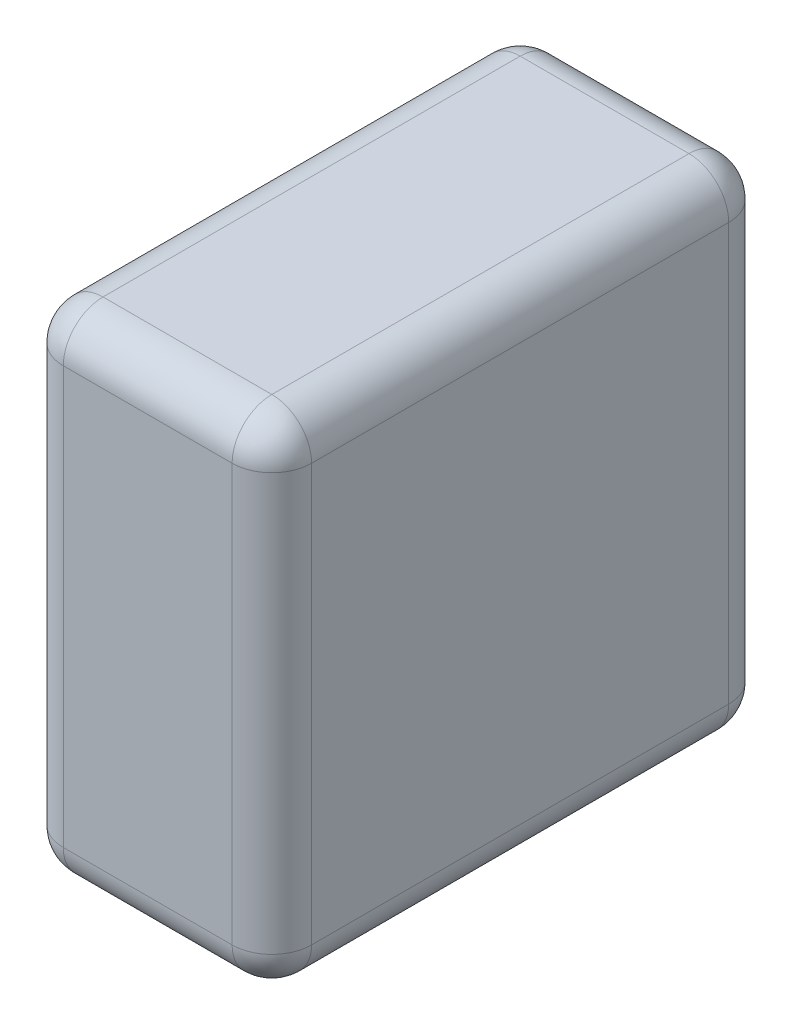
ISO-10303-21;
HEADER;
FILE_DESCRIPTION(('STEP AP214'),'2;1');
FILE_NAME('part.step','',(''),(''),'','','');
FILE_SCHEMA(('AUTOMOTIVE_DESIGN { 1 0 10303 214 1 1 1 1 }'));
ENDSEC;
DATA;
#1=APPLICATION_CONTEXT('core data for automotive mechanical design processes');
#2=APPLICATION_PROTOCOL_DEFINITION('international standard','automotive_design',2000,#1);
#3=PRODUCT_CONTEXT('',#1,'mechanical');
#4=PRODUCT('Part','Part','',(#3));
#5=PRODUCT_RELATED_PRODUCT_CATEGORY('part','',(#4));
#6=PRODUCT_DEFINITION_FORMATION('','',#4);
#7=PRODUCT_DEFINITION_CONTEXT('part definition',#1,'design');
#8=PRODUCT_DEFINITION('design','',#6,#7);
#9=PRODUCT_DEFINITION_SHAPE('','',#8);
#10=(LENGTH_UNIT() NAMED_UNIT(*) SI_UNIT(.MILLI.,.METRE.));
#11=(NAMED_UNIT(*) PLANE_ANGLE_UNIT() SI_UNIT($,.RADIAN.));
#12=(NAMED_UNIT(*) SI_UNIT($,.STERADIAN.) SOLID_ANGLE_UNIT());
#13=UNCERTAINTY_MEASURE_WITH_UNIT(LENGTH_MEASURE(1.E-05),#10,'distance_accuracy_value','');
#14=(GEOMETRIC_REPRESENTATION_CONTEXT(3) GLOBAL_UNCERTAINTY_ASSIGNED_CONTEXT((#13)) GLOBAL_UNIT_ASSIGNED_CONTEXT((#10,
#11,#12)) REPRESENTATION_CONTEXT('',''));
#15=CARTESIAN_POINT('',(0.,0.,0.));
#16=DIRECTION('',(0.,0.,1.));
#17=DIRECTION('',(1.,0.,0.));
#18=AXIS2_PLACEMENT_3D('',#15,#16,#17);
#19=CARTESIAN_POINT('',(0.79375,1.5875,1.5875));
#20=DIRECTION('',(0.,0.,-1.));
#21=DIRECTION('',(0.,1.,0.));
#22=AXIS2_PLACEMENT_3D('',#19,#20,#21);
#23=PLANE('',#22);
#24=DIRECTION('',(-1.,0.,0.));
#25=VECTOR('',#24,1.);
#26=CARTESIAN_POINT('',(0.79375,1.3335,1.5875));
#27=LINE('',#26,#25);
#28=CARTESIAN_POINT('',(0.53975,1.3335,1.5875));
#29=VERTEX_POINT('',#28);
#30=CARTESIAN_POINT('',(-0.53975,1.3335,1.5875));
#31=VERTEX_POINT('',#30);
#32=EDGE_CURVE('E514',#29,#31,#27,.T.);
#33=ORIENTED_EDGE('',*,*,#32,.T.);
#34=DIRECTION('',(0.,-1.,0.));
#35=VECTOR('',#34,1.);
#36=CARTESIAN_POINT('',(-0.53975,1.5875,1.5875));
#37=LINE('',#36,#35);
#38=CARTESIAN_POINT('',(-0.53975,-1.3335,1.5875));
#39=VERTEX_POINT('',#38);
#40=EDGE_CURVE('E519',#31,#39,#37,.T.);
#41=ORIENTED_EDGE('',*,*,#40,.T.);
#42=DIRECTION('',(-1.,0.,0.));
#43=VECTOR('',#42,1.);
#44=CARTESIAN_POINT('',(0.79375,-1.3335,1.5875));
#45=LINE('',#44,#43);
#46=CARTESIAN_POINT('',(0.53975,-1.3335,1.5875));
#47=VERTEX_POINT('',#46);
#48=EDGE_CURVE('E516',#39,#47,#45,.F.);
#49=ORIENTED_EDGE('',*,*,#48,.T.);
#50=DIRECTION('',(0.,-1.,0.));
#51=VECTOR('',#50,1.);
#52=CARTESIAN_POINT('',(0.53975,1.5875,1.5875));
#53=LINE('',#52,#51);
#54=EDGE_CURVE('E512',#47,#29,#53,.F.);
#55=ORIENTED_EDGE('',*,*,#54,.T.);
#56=EDGE_LOOP('',(#33,#41,#49,#55));
#57=FACE_BOUND('',#56,.T.);
#58=ADVANCED_FACE('F372',(#57),#23,.F.);
#59=CARTESIAN_POINT('',(0.79375,-1.5875,1.5875));
#60=DIRECTION('',(0.,1.,0.));
#61=DIRECTION('',(0.,0.,1.));
#62=AXIS2_PLACEMENT_3D('',#59,#60,#61);
#63=PLANE('',#62);
#64=DIRECTION('',(-1.,0.,0.));
#65=VECTOR('',#64,1.);
#66=CARTESIAN_POINT('',(0.79375,-1.5875,1.3335));
#67=LINE('',#66,#65);
#68=CARTESIAN_POINT('',(0.53975,-1.5875,1.3335));
#69=VERTEX_POINT('',#68);
#70=CARTESIAN_POINT('',(-0.53975,-1.5875,1.3335));
#71=VERTEX_POINT('',#70);
#72=EDGE_CURVE('E505',#69,#71,#67,.T.);
#73=ORIENTED_EDGE('',*,*,#72,.T.);
#74=DIRECTION('',(0.,0.,-1.));
#75=VECTOR('',#74,1.);
#76=CARTESIAN_POINT('',(-0.53975,-1.5875,1.5875));
#77=LINE('',#76,#75);
#78=CARTESIAN_POINT('',(-0.53975,-1.5875,-1.3335));
#79=VERTEX_POINT('',#78);
#80=EDGE_CURVE('E510',#71,#79,#77,.T.);
#81=ORIENTED_EDGE('',*,*,#80,.T.);
#82=DIRECTION('',(-1.,0.,0.));
#83=VECTOR('',#82,1.);
#84=CARTESIAN_POINT('',(0.79375,-1.5875,-1.3335));
#85=LINE('',#84,#83);
#86=CARTESIAN_POINT('',(0.53975,-1.5875,-1.3335));
#87=VERTEX_POINT('',#86);
#88=EDGE_CURVE('E507',#79,#87,#85,.F.);
#89=ORIENTED_EDGE('',*,*,#88,.T.);
#90=DIRECTION('',(0.,0.,-1.));
#91=VECTOR('',#90,1.);
#92=CARTESIAN_POINT('',(0.53975,-1.5875,1.5875));
#93=LINE('',#92,#91);
#94=EDGE_CURVE('E503',#87,#69,#93,.F.);
#95=ORIENTED_EDGE('',*,*,#94,.T.);
#96=EDGE_LOOP('',(#73,#81,#89,#95));
#97=FACE_BOUND('',#96,.T.);
#98=ADVANCED_FACE('F631',(#97),#63,.F.);
#99=CARTESIAN_POINT('',(0.79375,1.5875,-1.5875));
#100=DIRECTION('',(0.,0.,1.));
#101=DIRECTION('',(0.,-1.,0.));
#102=AXIS2_PLACEMENT_3D('',#99,#100,#101);
#103=PLANE('',#102);
#104=DIRECTION('',(-1.,0.,0.));
#105=VECTOR('',#104,1.);
#106=CARTESIAN_POINT('',(0.79375,-1.3335,-1.5875));
#107=LINE('',#106,#105);
#108=CARTESIAN_POINT('',(0.53975,-1.3335,-1.5875));
#109=VERTEX_POINT('',#108);
#110=CARTESIAN_POINT('',(-0.53975,-1.3335,-1.5875));
#111=VERTEX_POINT('',#110);
#112=EDGE_CURVE('E468',#109,#111,#107,.T.);
#113=ORIENTED_EDGE('',*,*,#112,.T.);
#114=DIRECTION('',(0.,1.,0.));
#115=VECTOR('',#114,1.);
#116=CARTESIAN_POINT('',(-0.53975,1.5875,-1.5875));
#117=LINE('',#116,#115);
#118=CARTESIAN_POINT('',(-0.53975,1.3335,-1.5875));
#119=VERTEX_POINT('',#118);
#120=EDGE_CURVE('E464',#111,#119,#117,.T.);
#121=ORIENTED_EDGE('',*,*,#120,.T.);
#122=DIRECTION('',(-1.,0.,0.));
#123=VECTOR('',#122,1.);
#124=CARTESIAN_POINT('',(0.79375,1.3335,-1.5875));
#125=LINE('',#124,#123);
#126=CARTESIAN_POINT('',(0.53975,1.3335,-1.5875));
#127=VERTEX_POINT('',#126);
#128=EDGE_CURVE('E456',#119,#127,#125,.F.);
#129=ORIENTED_EDGE('',*,*,#128,.T.);
#130=DIRECTION('',(0.,1.,0.));
#131=VECTOR('',#130,1.);
#132=CARTESIAN_POINT('',(0.53975,-1.5875,-1.5875));
#133=LINE('',#132,#131);
#134=EDGE_CURVE('E461',#127,#109,#133,.F.);
#135=ORIENTED_EDGE('',*,*,#134,.T.);
#136=EDGE_LOOP('',(#113,#121,#129,#135));
#137=FACE_BOUND('',#136,.T.);
#138=ADVANCED_FACE('F459',(#137),#103,.F.);
#139=CARTESIAN_POINT('',(0.79375,1.5875,1.5875));
#140=DIRECTION('',(0.,-1.,0.));
#141=DIRECTION('',(0.,0.,-1.));
#142=AXIS2_PLACEMENT_3D('',#139,#140,#141);
#143=PLANE('',#142);
#144=DIRECTION('',(-1.,0.,0.));
#145=VECTOR('',#144,1.);
#146=CARTESIAN_POINT('',(0.79375,1.5875,-1.3335));
#147=LINE('',#146,#145);
#148=CARTESIAN_POINT('',(0.53975,1.5875,-1.3335));
#149=VERTEX_POINT('',#148);
#150=CARTESIAN_POINT('',(-0.53975,1.5875,-1.3335));
#151=VERTEX_POINT('',#150);
#152=EDGE_CURVE('E476',#149,#151,#147,.T.);
#153=ORIENTED_EDGE('',*,*,#152,.T.);
#154=DIRECTION('',(0.,0.,1.));
#155=VECTOR('',#154,1.);
#156=CARTESIAN_POINT('',(-0.53975,1.5875,1.5875));
#157=LINE('',#156,#155);
#158=CARTESIAN_POINT('',(-0.53975,1.5875,1.3335));
#159=VERTEX_POINT('',#158);
#160=EDGE_CURVE('E526',#151,#159,#157,.T.);
#161=ORIENTED_EDGE('',*,*,#160,.T.);
#162=DIRECTION('',(-1.,0.,0.));
#163=VECTOR('',#162,1.);
#164=CARTESIAN_POINT('',(0.79375,1.5875,1.3335));
#165=LINE('',#164,#163);
#166=CARTESIAN_POINT('',(0.53975,1.5875,1.3335));
#167=VERTEX_POINT('',#166);
#168=EDGE_CURVE('E523',#159,#167,#165,.F.);
#169=ORIENTED_EDGE('',*,*,#168,.T.);
#170=DIRECTION('',(0.,0.,1.));
#171=VECTOR('',#170,1.);
#172=CARTESIAN_POINT('',(0.53975,1.5875,-1.5875));
#173=LINE('',#172,#171);
#174=EDGE_CURVE('E521',#167,#149,#173,.F.);
#175=ORIENTED_EDGE('',*,*,#174,.T.);
#176=EDGE_LOOP('',(#153,#161,#169,#175));
#177=FACE_BOUND('',#176,.T.);
#178=ADVANCED_FACE('F666',(#177),#143,.F.);
#179=CARTESIAN_POINT('',(0.79375,-1.5875,1.5875));
#180=DIRECTION('',(1.,0.,0.));
#181=DIRECTION('',(0.,0.,-1.));
#182=AXIS2_PLACEMENT_3D('',#179,#180,#181);
#183=PLANE('',#182);
#184=DIRECTION('',(0.,1.,0.));
#185=VECTOR('',#184,1.);
#186=CARTESIAN_POINT('',(0.79375,1.5875,-1.3335));
#187=LINE('',#186,#185);
#188=CARTESIAN_POINT('',(0.79375,-1.3335,-1.3335));
#189=VERTEX_POINT('',#188);
#190=CARTESIAN_POINT('',(0.79375,1.3335,-1.3335));
#191=VERTEX_POINT('',#190);
#192=EDGE_CURVE('E379',#189,#191,#187,.T.);
#193=ORIENTED_EDGE('',*,*,#192,.T.);
#194=DIRECTION('',(0.,0.,1.));
#195=VECTOR('',#194,1.);
#196=CARTESIAN_POINT('',(0.79375,1.3335,1.5875));
#197=LINE('',#196,#195);
#198=CARTESIAN_POINT('',(0.79375,1.3335,1.3335));
#199=VERTEX_POINT('',#198);
#200=EDGE_CURVE('E11',#191,#199,#197,.T.);
#201=ORIENTED_EDGE('',*,*,#200,.T.);
#202=DIRECTION('',(0.,-1.,0.));
#203=VECTOR('',#202,1.);
#204=CARTESIAN_POINT('',(0.79375,-1.5875,1.3335));
#205=LINE('',#204,#203);
#206=CARTESIAN_POINT('',(0.79375,-1.3335,1.3335));
#207=VERTEX_POINT('',#206);
#208=EDGE_CURVE('E537',#199,#207,#205,.T.);
#209=ORIENTED_EDGE('',*,*,#208,.T.);
#210=DIRECTION('',(0.,0.,-1.));
#211=VECTOR('',#210,1.);
#212=CARTESIAN_POINT('',(0.79375,-1.3335,-1.5875));
#213=LINE('',#212,#211);
#214=EDGE_CURVE('E389',#207,#189,#213,.T.);
#215=ORIENTED_EDGE('',*,*,#214,.T.);
#216=EDGE_LOOP('',(#193,#201,#209,#215));
#217=FACE_BOUND('',#216,.T.);
#218=ADVANCED_FACE('F540',(#217),#183,.T.);
#219=CARTESIAN_POINT('',(-0.79375,-1.5875,1.5875));
#220=DIRECTION('',(1.,0.,0.));
#221=DIRECTION('',(0.,0.,-1.));
#222=AXIS2_PLACEMENT_3D('',#219,#220,#221);
#223=PLANE('',#222);
#224=DIRECTION('',(0.,1.,0.));
#225=VECTOR('',#224,1.);
#226=CARTESIAN_POINT('',(-0.79375,-1.5875,-1.3335));
#227=LINE('',#226,#225);
#228=CARTESIAN_POINT('',(-0.79375,1.3335,-1.3335));
#229=VERTEX_POINT('',#228);
#230=CARTESIAN_POINT('',(-0.79375,-1.3335,-1.3335));
#231=VERTEX_POINT('',#230);
#232=EDGE_CURVE('E532',#229,#231,#227,.F.);
#233=ORIENTED_EDGE('',*,*,#232,.T.);
#234=DIRECTION('',(0.,0.,-1.));
#235=VECTOR('',#234,1.);
#236=CARTESIAN_POINT('',(-0.79375,-1.3335,1.5875));
#237=LINE('',#236,#235);
#238=CARTESIAN_POINT('',(-0.79375,-1.3335,1.3335));
#239=VERTEX_POINT('',#238);
#240=EDGE_CURVE('E534',#231,#239,#237,.F.);
#241=ORIENTED_EDGE('',*,*,#240,.T.);
#242=DIRECTION('',(0.,-1.,0.));
#243=VECTOR('',#242,1.);
#244=CARTESIAN_POINT('',(-0.79375,-1.5875,1.3335));
#245=LINE('',#244,#243);
#246=CARTESIAN_POINT('',(-0.79375,1.3335,1.3335));
#247=VERTEX_POINT('',#246);
#248=EDGE_CURVE('E528',#239,#247,#245,.F.);
#249=ORIENTED_EDGE('',*,*,#248,.T.);
#250=DIRECTION('',(0.,0.,1.));
#251=VECTOR('',#250,1.);
#252=CARTESIAN_POINT('',(-0.79375,1.3335,1.5875));
#253=LINE('',#252,#251);
#254=EDGE_CURVE('E530',#247,#229,#253,.F.);
#255=ORIENTED_EDGE('',*,*,#254,.T.);
#256=EDGE_LOOP('',(#233,#241,#249,#255));
#257=FACE_BOUND('',#256,.T.);
#258=ADVANCED_FACE('F616',(#257),#223,.F.);
#259=CARTESIAN_POINT('',(0.79375,1.3335,1.3335));
#260=DIRECTION('',(-1.,0.,0.));
#261=DIRECTION('',(0.,0.,1.));
#262=AXIS2_PLACEMENT_3D('',#259,#260,#261);
#263=CYLINDRICAL_SURFACE('',#262,0.254);
#264=CARTESIAN_POINT('',(0.53975,1.3335,1.3335));
#265=DIRECTION('',(1.,0.,0.));
#266=DIRECTION('',(0.,0.,-1.));
#267=AXIS2_PLACEMENT_3D('',#264,#265,#266);
#268=CIRCLE('',#267,0.254);
#269=EDGE_CURVE('E494',#167,#29,#268,.T.);
#270=ORIENTED_EDGE('',*,*,#269,.F.);
#271=ORIENTED_EDGE('',*,*,#168,.F.);
#272=CARTESIAN_POINT('',(-0.53975,1.3335,1.3335));
#273=DIRECTION('',(-1.,0.,0.));
#274=DIRECTION('',(0.,0.,1.));
#275=AXIS2_PLACEMENT_3D('',#272,#273,#274);
#276=CIRCLE('',#275,0.254);
#277=EDGE_CURVE('E497',#31,#159,#276,.T.);
#278=ORIENTED_EDGE('',*,*,#277,.F.);
#279=ORIENTED_EDGE('',*,*,#32,.F.);
#280=EDGE_LOOP('',(#270,#271,#278,#279));
#281=FACE_BOUND('',#280,.T.);
#282=ADVANCED_FACE('F676',(#281),#263,.T.);
#283=CARTESIAN_POINT('',(0.53975,1.3335,1.3335));
#284=DIRECTION('',(0.,0.,1.));
#285=DIRECTION('',(1.,0.,0.));
#286=AXIS2_PLACEMENT_3D('',#283,#284,#285);
#287=SPHERICAL_SURFACE('',#286,0.254);
#288=CARTESIAN_POINT('',(0.53975,1.3335,1.3335));
#289=DIRECTION('',(0.,0.,1.));
#290=DIRECTION('',(1.,0.,0.));
#291=AXIS2_PLACEMENT_3D('',#288,#289,#290);
#292=CIRCLE('',#291,0.254);
#293=EDGE_CURVE('E595',#167,#199,#292,.F.);
#294=ORIENTED_EDGE('',*,*,#293,.F.);
#295=ORIENTED_EDGE('',*,*,#269,.T.);
#296=CARTESIAN_POINT('',(0.53975,1.3335,1.3335));
#297=DIRECTION('',(0.,1.,0.));
#298=DIRECTION('',(0.,0.,1.));
#299=AXIS2_PLACEMENT_3D('',#296,#297,#298);
#300=CIRCLE('',#299,0.254);
#301=EDGE_CURVE('E598',#199,#29,#300,.F.);
#302=ORIENTED_EDGE('',*,*,#301,.F.);
#303=EDGE_LOOP('',(#294,#295,#302));
#304=FACE_BOUND('',#303,.T.);
#305=ADVANCED_FACE('F679',(#304),#287,.T.);
#306=CARTESIAN_POINT('',(-0.53975,1.3335,1.3335));
#307=DIRECTION('',(0.,0.,1.));
#308=DIRECTION('',(1.,0.,0.));
#309=AXIS2_PLACEMENT_3D('',#306,#307,#308);
#310=SPHERICAL_SURFACE('',#309,0.254);
#311=CARTESIAN_POINT('',(-0.53975,1.3335,1.3335));
#312=DIRECTION('',(0.,1.,0.));
#313=DIRECTION('',(0.,0.,1.));
#314=AXIS2_PLACEMENT_3D('',#311,#312,#313);
#315=CIRCLE('',#314,0.254);
#316=EDGE_CURVE('E589',#31,#247,#315,.F.);
#317=ORIENTED_EDGE('',*,*,#316,.F.);
#318=ORIENTED_EDGE('',*,*,#277,.T.);
#319=CARTESIAN_POINT('',(-0.53975,1.3335,1.3335));
#320=DIRECTION('',(0.,0.,1.));
#321=DIRECTION('',(1.,0.,0.));
#322=AXIS2_PLACEMENT_3D('',#319,#320,#321);
#323=CIRCLE('',#322,0.254);
#324=EDGE_CURVE('E592',#247,#159,#323,.F.);
#325=ORIENTED_EDGE('',*,*,#324,.F.);
#326=EDGE_LOOP('',(#317,#318,#325));
#327=FACE_BOUND('',#326,.T.);
#328=ADVANCED_FACE('F604',(#327),#310,.T.);
#329=CARTESIAN_POINT('',(0.53975,-1.5875,1.3335));
#330=DIRECTION('',(0.,1.,0.));
#331=DIRECTION('',(0.,0.,1.));
#332=AXIS2_PLACEMENT_3D('',#329,#330,#331);
#333=CYLINDRICAL_SURFACE('',#332,0.254);
#334=ORIENTED_EDGE('',*,*,#301,.T.);
#335=ORIENTED_EDGE('',*,*,#54,.F.);
#336=CARTESIAN_POINT('',(0.53975,-1.3335,1.3335));
#337=DIRECTION('',(0.,-1.,0.));
#338=DIRECTION('',(0.,0.,-1.));
#339=AXIS2_PLACEMENT_3D('',#336,#337,#338);
#340=CIRCLE('',#339,0.254);
#341=EDGE_CURVE('E545',#207,#47,#340,.T.);
#342=ORIENTED_EDGE('',*,*,#341,.F.);
#343=ORIENTED_EDGE('',*,*,#208,.F.);
#344=EDGE_LOOP('',(#334,#335,#342,#343));
#345=FACE_BOUND('',#344,.T.);
#346=ADVANCED_FACE('F547',(#345),#333,.T.);
#347=CARTESIAN_POINT('',(0.53975,1.3335,1.5875));
#348=DIRECTION('',(0.,0.,-1.));
#349=DIRECTION('',(-1.,0.,0.));
#350=AXIS2_PLACEMENT_3D('',#347,#348,#349);
#351=CYLINDRICAL_SURFACE('',#350,0.254);
#352=ORIENTED_EDGE('',*,*,#293,.T.);
#353=ORIENTED_EDGE('',*,*,#200,.F.);
#354=CARTESIAN_POINT('',(0.53975,1.3335,-1.3335));
#355=DIRECTION('',(0.,0.,-1.));
#356=DIRECTION('',(-1.,0.,0.));
#357=AXIS2_PLACEMENT_3D('',#354,#355,#356);
#358=CIRCLE('',#357,0.254);
#359=EDGE_CURVE('E480',#149,#191,#358,.T.);
#360=ORIENTED_EDGE('',*,*,#359,.F.);
#361=ORIENTED_EDGE('',*,*,#174,.F.);
#362=EDGE_LOOP('',(#352,#353,#360,#361));
#363=FACE_BOUND('',#362,.T.);
#364=ADVANCED_FACE('F687',(#363),#351,.T.);
#365=CARTESIAN_POINT('',(0.79375,1.3335,-1.3335));
#366=DIRECTION('',(-1.,0.,0.));
#367=DIRECTION('',(0.,0.,1.));
#368=AXIS2_PLACEMENT_3D('',#365,#366,#367);
#369=CYLINDRICAL_SURFACE('',#368,0.254);
#370=CARTESIAN_POINT('',(-0.53975,1.3335,-1.3335));
#371=DIRECTION('',(-1.,0.,0.));
#372=DIRECTION('',(0.,0.,1.));
#373=AXIS2_PLACEMENT_3D('',#370,#371,#372);
#374=CIRCLE('',#373,0.254);
#375=EDGE_CURVE('E481',#151,#119,#374,.T.);
#376=ORIENTED_EDGE('',*,*,#375,.F.);
#377=ORIENTED_EDGE('',*,*,#152,.F.);
#378=CARTESIAN_POINT('',(0.53975,1.3335,-1.3335));
#379=DIRECTION('',(1.,0.,0.));
#380=DIRECTION('',(0.,0.,-1.));
#381=AXIS2_PLACEMENT_3D('',#378,#379,#380);
#382=CIRCLE('',#381,0.254);
#383=EDGE_CURVE('E472',#127,#149,#382,.T.);
#384=ORIENTED_EDGE('',*,*,#383,.F.);
#385=ORIENTED_EDGE('',*,*,#128,.F.);
#386=EDGE_LOOP('',(#376,#377,#384,#385));
#387=FACE_BOUND('',#386,.T.);
#388=ADVANCED_FACE('F474',(#387),#369,.T.);
#389=CARTESIAN_POINT('',(-0.53975,1.3335,1.5875));
#390=DIRECTION('',(0.,0.,1.));
#391=DIRECTION('',(1.,0.,0.));
#392=AXIS2_PLACEMENT_3D('',#389,#390,#391);
#393=CYLINDRICAL_SURFACE('',#392,0.254);
#394=ORIENTED_EDGE('',*,*,#324,.T.);
#395=ORIENTED_EDGE('',*,*,#160,.F.);
#396=CARTESIAN_POINT('',(-0.53975,1.3335,-1.3335));
#397=DIRECTION('',(0.,0.,-1.));
#398=DIRECTION('',(-1.,0.,0.));
#399=AXIS2_PLACEMENT_3D('',#396,#397,#398);
#400=CIRCLE('',#399,0.254);
#401=EDGE_CURVE('E584',#229,#151,#400,.T.);
#402=ORIENTED_EDGE('',*,*,#401,.F.);
#403=ORIENTED_EDGE('',*,*,#254,.F.);
#404=EDGE_LOOP('',(#394,#395,#402,#403));
#405=FACE_BOUND('',#404,.T.);
#406=ADVANCED_FACE('F612',(#405),#393,.T.);
#407=CARTESIAN_POINT('',(-0.53975,1.5875,1.3335));
#408=DIRECTION('',(0.,-1.,0.));
#409=DIRECTION('',(0.,0.,-1.));
#410=AXIS2_PLACEMENT_3D('',#407,#408,#409);
#411=CYLINDRICAL_SURFACE('',#410,0.254);
#412=ORIENTED_EDGE('',*,*,#316,.T.);
#413=ORIENTED_EDGE('',*,*,#248,.F.);
#414=CARTESIAN_POINT('',(-0.53975,-1.3335,1.3335));
#415=DIRECTION('',(0.,-1.,0.));
#416=DIRECTION('',(0.,0.,-1.));
#417=AXIS2_PLACEMENT_3D('',#414,#415,#416);
#418=CIRCLE('',#417,0.254);
#419=EDGE_CURVE('E581',#39,#239,#418,.T.);
#420=ORIENTED_EDGE('',*,*,#419,.F.);
#421=ORIENTED_EDGE('',*,*,#40,.F.);
#422=EDGE_LOOP('',(#412,#413,#420,#421));
#423=FACE_BOUND('',#422,.T.);
#424=ADVANCED_FACE('F622',(#423),#411,.T.);
#425=CARTESIAN_POINT('',(0.79375,-1.3335,1.3335));
#426=DIRECTION('',(-1.,0.,0.));
#427=DIRECTION('',(0.,0.,1.));
#428=AXIS2_PLACEMENT_3D('',#425,#426,#427);
#429=CYLINDRICAL_SURFACE('',#428,0.254);
#430=CARTESIAN_POINT('',(0.53975,-1.3335,1.3335));
#431=DIRECTION('',(1.,0.,0.));
#432=DIRECTION('',(0.,0.,-1.));
#433=AXIS2_PLACEMENT_3D('',#430,#431,#432);
#434=CIRCLE('',#433,0.254);
#435=EDGE_CURVE('E551',#47,#69,#434,.T.);
#436=ORIENTED_EDGE('',*,*,#435,.F.);
#437=ORIENTED_EDGE('',*,*,#48,.F.);
#438=CARTESIAN_POINT('',(-0.53975,-1.3335,1.3335));
#439=DIRECTION('',(-1.,0.,0.));
#440=DIRECTION('',(0.,0.,1.));
#441=AXIS2_PLACEMENT_3D('',#438,#439,#440);
#442=CIRCLE('',#441,0.254);
#443=EDGE_CURVE('E557',#71,#39,#442,.T.);
#444=ORIENTED_EDGE('',*,*,#443,.F.);
#445=ORIENTED_EDGE('',*,*,#72,.F.);
#446=EDGE_LOOP('',(#436,#437,#444,#445));
#447=FACE_BOUND('',#446,.T.);
#448=ADVANCED_FACE('F627',(#447),#429,.T.);
#449=CARTESIAN_POINT('',(0.53975,-1.3335,1.3335));
#450=DIRECTION('',(0.,0.,1.));
#451=DIRECTION('',(1.,0.,0.));
#452=AXIS2_PLACEMENT_3D('',#449,#450,#451);
#453=SPHERICAL_SURFACE('',#452,0.254);
#454=ORIENTED_EDGE('',*,*,#341,.T.);
#455=ORIENTED_EDGE('',*,*,#435,.T.);
#456=CARTESIAN_POINT('',(0.53975,-1.3335,1.3335));
#457=DIRECTION('',(0.,0.,1.));
#458=DIRECTION('',(1.,0.,0.));
#459=AXIS2_PLACEMENT_3D('',#456,#457,#458);
#460=CIRCLE('',#459,0.254);
#461=EDGE_CURVE('E487',#207,#69,#460,.F.);
#462=ORIENTED_EDGE('',*,*,#461,.F.);
#463=EDGE_LOOP('',(#454,#455,#462));
#464=FACE_BOUND('',#463,.T.);
#465=ADVANCED_FACE('F554',(#464),#453,.T.);
#466=CARTESIAN_POINT('',(0.53975,1.3335,-1.3335));
#467=DIRECTION('',(0.,0.,1.));
#468=DIRECTION('',(1.,0.,0.));
#469=AXIS2_PLACEMENT_3D('',#466,#467,#468);
#470=SPHERICAL_SURFACE('',#469,0.254);
#471=ORIENTED_EDGE('',*,*,#383,.T.);
#472=ORIENTED_EDGE('',*,*,#359,.T.);
#473=CARTESIAN_POINT('',(0.53975,1.3335,-1.3335));
#474=DIRECTION('',(0.,1.,0.));
#475=DIRECTION('',(0.,0.,1.));
#476=AXIS2_PLACEMENT_3D('',#473,#474,#475);
#477=CIRCLE('',#476,0.254);
#478=EDGE_CURVE('E484',#127,#191,#477,.F.);
#479=ORIENTED_EDGE('',*,*,#478,.F.);
#480=EDGE_LOOP('',(#471,#472,#479));
#481=FACE_BOUND('',#480,.T.);
#482=ADVANCED_FACE('F485',(#481),#470,.T.);
#483=CARTESIAN_POINT('',(-0.53975,1.3335,-1.3335));
#484=DIRECTION('',(0.,0.,1.));
#485=DIRECTION('',(1.,0.,0.));
#486=AXIS2_PLACEMENT_3D('',#483,#484,#485);
#487=SPHERICAL_SURFACE('',#486,0.254);
#488=ORIENTED_EDGE('',*,*,#401,.T.);
#489=ORIENTED_EDGE('',*,*,#375,.T.);
#490=CARTESIAN_POINT('',(-0.53975,1.3335,-1.3335));
#491=DIRECTION('',(0.,1.,0.));
#492=DIRECTION('',(0.,0.,1.));
#493=AXIS2_PLACEMENT_3D('',#490,#491,#492);
#494=CIRCLE('',#493,0.254);
#495=EDGE_CURVE('E488',#229,#119,#494,.F.);
#496=ORIENTED_EDGE('',*,*,#495,.F.);
#497=EDGE_LOOP('',(#488,#489,#496));
#498=FACE_BOUND('',#497,.T.);
#499=ADVANCED_FACE('F648',(#498),#487,.T.);
#500=CARTESIAN_POINT('',(-0.53975,-1.3335,1.3335));
#501=DIRECTION('',(0.,0.,1.));
#502=DIRECTION('',(1.,0.,0.));
#503=AXIS2_PLACEMENT_3D('',#500,#501,#502);
#504=SPHERICAL_SURFACE('',#503,0.254);
#505=ORIENTED_EDGE('',*,*,#443,.T.);
#506=ORIENTED_EDGE('',*,*,#419,.T.);
#507=CARTESIAN_POINT('',(-0.53975,-1.3335,1.3335));
#508=DIRECTION('',(0.,0.,1.));
#509=DIRECTION('',(1.,0.,0.));
#510=AXIS2_PLACEMENT_3D('',#507,#508,#509);
#511=CIRCLE('',#510,0.254);
#512=EDGE_CURVE('E564',#71,#239,#511,.F.);
#513=ORIENTED_EDGE('',*,*,#512,.F.);
#514=EDGE_LOOP('',(#505,#506,#513));
#515=FACE_BOUND('',#514,.T.);
#516=ADVANCED_FACE('F650',(#515),#504,.T.);
#517=CARTESIAN_POINT('',(0.53975,-1.3335,1.5875));
#518=DIRECTION('',(0.,0.,1.));
#519=DIRECTION('',(1.,0.,0.));
#520=AXIS2_PLACEMENT_3D('',#517,#518,#519);
#521=CYLINDRICAL_SURFACE('',#520,0.254);
#522=ORIENTED_EDGE('',*,*,#461,.T.);
#523=ORIENTED_EDGE('',*,*,#94,.F.);
#524=CARTESIAN_POINT('',(0.53975,-1.3335,-1.3335));
#525=DIRECTION('',(0.,0.,-1.));
#526=DIRECTION('',(-1.,0.,0.));
#527=AXIS2_PLACEMENT_3D('',#524,#525,#526);
#528=CIRCLE('',#527,0.254);
#529=EDGE_CURVE('E562',#189,#87,#528,.T.);
#530=ORIENTED_EDGE('',*,*,#529,.F.);
#531=ORIENTED_EDGE('',*,*,#214,.F.);
#532=EDGE_LOOP('',(#522,#523,#530,#531));
#533=FACE_BOUND('',#532,.T.);
#534=ADVANCED_FACE('F560',(#533),#521,.T.);
#535=CARTESIAN_POINT('',(0.53975,-1.5875,-1.3335));
#536=DIRECTION('',(0.,-1.,0.));
#537=DIRECTION('',(0.,0.,-1.));
#538=AXIS2_PLACEMENT_3D('',#535,#536,#537);
#539=CYLINDRICAL_SURFACE('',#538,0.254);
#540=ORIENTED_EDGE('',*,*,#478,.T.);
#541=ORIENTED_EDGE('',*,*,#192,.F.);
#542=CARTESIAN_POINT('',(0.53975,-1.3335,-1.3335));
#543=DIRECTION('',(0.,-1.,0.));
#544=DIRECTION('',(0.,0.,-1.));
#545=AXIS2_PLACEMENT_3D('',#542,#543,#544);
#546=CIRCLE('',#545,0.254);
#547=EDGE_CURVE('E492',#109,#189,#546,.T.);
#548=ORIENTED_EDGE('',*,*,#547,.F.);
#549=ORIENTED_EDGE('',*,*,#134,.F.);
#550=EDGE_LOOP('',(#540,#541,#548,#549));
#551=FACE_BOUND('',#550,.T.);
#552=ADVANCED_FACE('F490',(#551),#539,.T.);
#553=CARTESIAN_POINT('',(-0.53975,1.5875,-1.3335));
#554=DIRECTION('',(0.,1.,0.));
#555=DIRECTION('',(0.,0.,1.));
#556=AXIS2_PLACEMENT_3D('',#553,#554,#555);
#557=CYLINDRICAL_SURFACE('',#556,0.254);
#558=ORIENTED_EDGE('',*,*,#495,.T.);
#559=ORIENTED_EDGE('',*,*,#120,.F.);
#560=CARTESIAN_POINT('',(-0.53975,-1.3335,-1.3335));
#561=DIRECTION('',(0.,-1.,0.));
#562=DIRECTION('',(0.,0.,-1.));
#563=AXIS2_PLACEMENT_3D('',#560,#561,#562);
#564=CIRCLE('',#563,0.254);
#565=EDGE_CURVE('E569',#231,#111,#564,.T.);
#566=ORIENTED_EDGE('',*,*,#565,.F.);
#567=ORIENTED_EDGE('',*,*,#232,.F.);
#568=EDGE_LOOP('',(#558,#559,#566,#567));
#569=FACE_BOUND('',#568,.T.);
#570=ADVANCED_FACE('F646',(#569),#557,.T.);
#571=CARTESIAN_POINT('',(-0.53975,-1.3335,1.5875));
#572=DIRECTION('',(0.,0.,-1.));
#573=DIRECTION('',(-1.,0.,0.));
#574=AXIS2_PLACEMENT_3D('',#571,#572,#573);
#575=CYLINDRICAL_SURFACE('',#574,0.254);
#576=ORIENTED_EDGE('',*,*,#512,.T.);
#577=ORIENTED_EDGE('',*,*,#240,.F.);
#578=CARTESIAN_POINT('',(-0.53975,-1.3335,-1.3335));
#579=DIRECTION('',(0.,0.,-1.));
#580=DIRECTION('',(-1.,0.,0.));
#581=AXIS2_PLACEMENT_3D('',#578,#579,#580);
#582=CIRCLE('',#581,0.254);
#583=EDGE_CURVE('E572',#79,#231,#582,.T.);
#584=ORIENTED_EDGE('',*,*,#583,.F.);
#585=ORIENTED_EDGE('',*,*,#80,.F.);
#586=EDGE_LOOP('',(#576,#577,#584,#585));
#587=FACE_BOUND('',#586,.T.);
#588=ADVANCED_FACE('F733',(#587),#575,.T.);
#589=CARTESIAN_POINT('',(0.53975,-1.3335,-1.3335));
#590=DIRECTION('',(0.,0.,1.));
#591=DIRECTION('',(1.,0.,0.));
#592=AXIS2_PLACEMENT_3D('',#589,#590,#591);
#593=SPHERICAL_SURFACE('',#592,0.254);
#594=ORIENTED_EDGE('',*,*,#547,.T.);
#595=ORIENTED_EDGE('',*,*,#529,.T.);
#596=CARTESIAN_POINT('',(0.53975,-1.3335,-1.3335));
#597=DIRECTION('',(1.,0.,0.));
#598=DIRECTION('',(0.,0.,-1.));
#599=AXIS2_PLACEMENT_3D('',#596,#597,#598);
#600=CIRCLE('',#599,0.254);
#601=EDGE_CURVE('E567',#109,#87,#600,.F.);
#602=ORIENTED_EDGE('',*,*,#601,.F.);
#603=EDGE_LOOP('',(#594,#595,#602));
#604=FACE_BOUND('',#603,.T.);
#605=ADVANCED_FACE('F566',(#604),#593,.T.);
#606=CARTESIAN_POINT('',(-0.53975,-1.3335,-1.3335));
#607=DIRECTION('',(0.,0.,1.));
#608=DIRECTION('',(1.,0.,0.));
#609=AXIS2_PLACEMENT_3D('',#606,#607,#608);
#610=SPHERICAL_SURFACE('',#609,0.254);
#611=ORIENTED_EDGE('',*,*,#583,.T.);
#612=ORIENTED_EDGE('',*,*,#565,.T.);
#613=CARTESIAN_POINT('',(-0.53975,-1.3335,-1.3335));
#614=DIRECTION('',(-1.,0.,0.));
#615=DIRECTION('',(0.,0.,1.));
#616=AXIS2_PLACEMENT_3D('',#613,#614,#615);
#617=CIRCLE('',#616,0.254);
#618=EDGE_CURVE('E638',#79,#111,#617,.F.);
#619=ORIENTED_EDGE('',*,*,#618,.F.);
#620=EDGE_LOOP('',(#611,#612,#619));
#621=FACE_BOUND('',#620,.T.);
#622=ADVANCED_FACE('F641',(#621),#610,.T.);
#623=CARTESIAN_POINT('',(0.79375,-1.3335,-1.3335));
#624=DIRECTION('',(-1.,0.,0.));
#625=DIRECTION('',(0.,0.,1.));
#626=AXIS2_PLACEMENT_3D('',#623,#624,#625);
#627=CYLINDRICAL_SURFACE('',#626,0.254);
#628=ORIENTED_EDGE('',*,*,#601,.T.);
#629=ORIENTED_EDGE('',*,*,#88,.F.);
#630=ORIENTED_EDGE('',*,*,#618,.T.);
#631=ORIENTED_EDGE('',*,*,#112,.F.);
#632=EDGE_LOOP('',(#628,#629,#630,#631));
#633=FACE_BOUND('',#632,.T.);
#634=ADVANCED_FACE('F637',(#633),#627,.T.);
#635=CLOSED_SHELL('',(#58,#98,#138,#178,#218,#258,#282,#305,#328,#346,#364,#388,#406,#424,#448,
#465,#482,#499,#516,#534,#552,#570,#588,#605,#622,#634));
#636=MANIFOLD_SOLID_BREP('B2',#635);
#637=ADVANCED_BREP_SHAPE_REPRESENTATION('',(#18,#636),#14);
#638=SHAPE_DEFINITION_REPRESENTATION(#9,#637);
ENDSEC;
END-ISO-10303-21;
